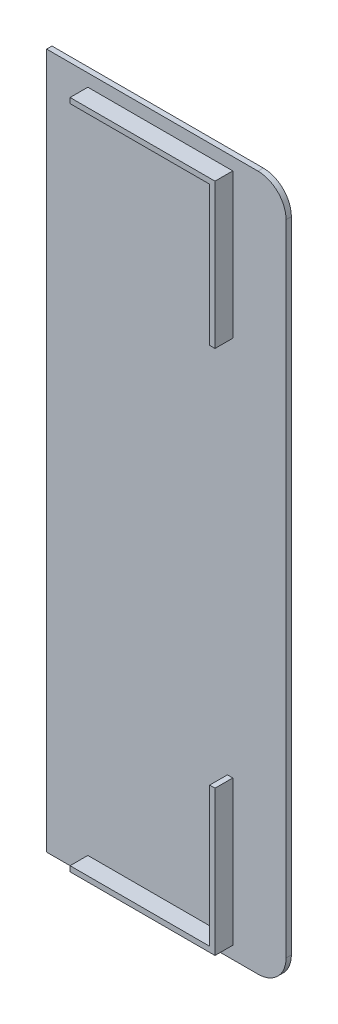
ISO-10303-21;
HEADER;
FILE_DESCRIPTION(('STEP AP214'),'2;1');
FILE_NAME('part.step','',(''),(''),'','','');
FILE_SCHEMA(('AUTOMOTIVE_DESIGN { 1 0 10303 214 1 1 1 1 }'));
ENDSEC;
DATA;
#1=APPLICATION_CONTEXT('core data for automotive mechanical design processes');
#2=APPLICATION_PROTOCOL_DEFINITION('international standard','automotive_design',2000,#1);
#3=PRODUCT_CONTEXT('',#1,'mechanical');
#4=PRODUCT('Part','Part','',(#3));
#5=PRODUCT_RELATED_PRODUCT_CATEGORY('part','',(#4));
#6=PRODUCT_DEFINITION_FORMATION('','',#4);
#7=PRODUCT_DEFINITION_CONTEXT('part definition',#1,'design');
#8=PRODUCT_DEFINITION('design','',#6,#7);
#9=PRODUCT_DEFINITION_SHAPE('','',#8);
#10=(LENGTH_UNIT() NAMED_UNIT(*) SI_UNIT(.MILLI.,.METRE.));
#11=(NAMED_UNIT(*) PLANE_ANGLE_UNIT() SI_UNIT($,.RADIAN.));
#12=(NAMED_UNIT(*) SI_UNIT($,.STERADIAN.) SOLID_ANGLE_UNIT());
#13=UNCERTAINTY_MEASURE_WITH_UNIT(LENGTH_MEASURE(1.E-05),#10,'distance_accuracy_value','');
#14=(GEOMETRIC_REPRESENTATION_CONTEXT(3) GLOBAL_UNCERTAINTY_ASSIGNED_CONTEXT((#13)) GLOBAL_UNIT_ASSIGNED_CONTEXT((#10,
#11,#12)) REPRESENTATION_CONTEXT('',''));
#15=CARTESIAN_POINT('',(0.,0.,0.));
#16=DIRECTION('',(0.,0.,1.));
#17=DIRECTION('',(1.,0.,0.));
#18=AXIS2_PLACEMENT_3D('',#15,#16,#17);
#19=CARTESIAN_POINT('',(0.,0.,-60.5));
#20=DIRECTION('',(0.,0.,1.));
#21=DIRECTION('',(1.,0.,0.));
#22=AXIS2_PLACEMENT_3D('',#19,#20,#21);
#23=PLANE('',#22);
#24=DIRECTION('',(0.,-1.,0.));
#25=VECTOR('',#24,1.);
#26=CARTESIAN_POINT('',(141.4,0.,-60.5));
#27=LINE('',#26,#25);
#28=CARTESIAN_POINT('',(141.4,92.9,-60.5));
#29=VERTEX_POINT('',#28);
#30=CARTESIAN_POINT('',(141.4,53.6,-60.5));
#31=VERTEX_POINT('',#30);
#32=EDGE_CURVE('E193',#29,#31,#27,.T.);
#33=ORIENTED_EDGE('',*,*,#32,.F.);
#34=DIRECTION('',(1.,0.,0.));
#35=VECTOR('',#34,1.);
#36=CARTESIAN_POINT('',(0.,92.9,-60.5));
#37=LINE('',#36,#35);
#38=CARTESIAN_POINT('',(102.1,92.9,-60.5));
#39=VERTEX_POINT('',#38);
#40=EDGE_CURVE('E179',#39,#29,#37,.T.);
#41=ORIENTED_EDGE('',*,*,#40,.F.);
#42=DIRECTION('',(0.,-1.,0.));
#43=VECTOR('',#42,1.);
#44=CARTESIAN_POINT('',(102.099999999998,-1.88922951357044E-12,-60.5));
#45=LINE('',#44,#43);
#46=CARTESIAN_POINT('',(102.1,94.4,-60.5));
#47=VERTEX_POINT('',#46);
#48=EDGE_CURVE('E170',#47,#39,#45,.T.);
#49=ORIENTED_EDGE('',*,*,#48,.F.);
#50=DIRECTION('',(-1.,0.,0.));
#51=VECTOR('',#50,1.);
#52=CARTESIAN_POINT('',(0.,94.4,-60.5));
#53=LINE('',#52,#51);
#54=CARTESIAN_POINT('',(142.9,94.4,-60.5));
#55=VERTEX_POINT('',#54);
#56=EDGE_CURVE('E188',#55,#47,#53,.T.);
#57=ORIENTED_EDGE('',*,*,#56,.F.);
#58=DIRECTION('',(0.,1.,0.));
#59=VECTOR('',#58,1.);
#60=CARTESIAN_POINT('',(142.9,0.,-60.5));
#61=LINE('',#60,#59);
#62=CARTESIAN_POINT('',(142.9,53.6,-60.5));
#63=VERTEX_POINT('',#62);
#64=EDGE_CURVE('E52',#63,#55,#61,.T.);
#65=ORIENTED_EDGE('',*,*,#64,.F.);
#66=DIRECTION('',(1.,0.,0.));
#67=VECTOR('',#66,1.);
#68=CARTESIAN_POINT('',(0.,53.6,-60.5));
#69=LINE('',#68,#67);
#70=EDGE_CURVE('E47',#31,#63,#69,.T.);
#71=ORIENTED_EDGE('',*,*,#70,.F.);
#72=EDGE_LOOP('',(#33,#41,#49,#57,#65,#71));
#73=FACE_BOUND('',#72,.T.);
#74=DIRECTION('',(0.,-1.,0.));
#75=VECTOR('',#74,1.);
#76=CARTESIAN_POINT('',(141.4,0.,-60.5));
#77=LINE('',#76,#75);
#78=CARTESIAN_POINT('',(141.4,-53.6,-60.5));
#79=VERTEX_POINT('',#78);
#80=CARTESIAN_POINT('',(141.4,-92.9,-60.5));
#81=VERTEX_POINT('',#80);
#82=EDGE_CURVE('E240',#79,#81,#77,.T.);
#83=ORIENTED_EDGE('',*,*,#82,.F.);
#84=DIRECTION('',(-1.,0.,0.));
#85=VECTOR('',#84,1.);
#86=CARTESIAN_POINT('',(0.,-53.6,-60.5));
#87=LINE('',#86,#85);
#88=CARTESIAN_POINT('',(142.9,-53.6,-60.5));
#89=VERTEX_POINT('',#88);
#90=EDGE_CURVE('E225',#89,#79,#87,.T.);
#91=ORIENTED_EDGE('',*,*,#90,.F.);
#92=DIRECTION('',(0.,1.,0.));
#93=VECTOR('',#92,1.);
#94=CARTESIAN_POINT('',(142.9,0.,-60.5));
#95=LINE('',#94,#93);
#96=CARTESIAN_POINT('',(142.9,-94.4,-60.5));
#97=VERTEX_POINT('',#96);
#98=EDGE_CURVE('E228',#97,#89,#95,.T.);
#99=ORIENTED_EDGE('',*,*,#98,.F.);
#100=DIRECTION('',(1.,0.,0.));
#101=VECTOR('',#100,1.);
#102=CARTESIAN_POINT('',(0.,-94.4,-60.5));
#103=LINE('',#102,#101);
#104=CARTESIAN_POINT('',(102.1,-94.4,-60.5));
#105=VERTEX_POINT('',#104);
#106=EDGE_CURVE('E231',#105,#97,#103,.T.);
#107=ORIENTED_EDGE('',*,*,#106,.F.);
#108=DIRECTION('',(0.,-1.,0.));
#109=VECTOR('',#108,1.);
#110=CARTESIAN_POINT('',(102.1,0.,-60.5));
#111=LINE('',#110,#109);
#112=CARTESIAN_POINT('',(102.1,-92.9,-60.5));
#113=VERTEX_POINT('',#112);
#114=EDGE_CURVE('E234',#113,#105,#111,.T.);
#115=ORIENTED_EDGE('',*,*,#114,.F.);
#116=DIRECTION('',(-1.,0.,0.));
#117=VECTOR('',#116,1.);
#118=CARTESIAN_POINT('',(0.,-92.9,-60.5));
#119=LINE('',#118,#117);
#120=EDGE_CURVE('E237',#81,#113,#119,.T.);
#121=ORIENTED_EDGE('',*,*,#120,.F.);
#122=EDGE_LOOP('',(#83,#91,#99,#107,#115,#121));
#123=FACE_BOUND('',#122,.T.);
#124=DIRECTION('',(0.,1.,0.));
#125=VECTOR('',#124,1.);
#126=CARTESIAN_POINT('',(90.5,-97.9,-60.5));
#127=LINE('',#126,#125);
#128=CARTESIAN_POINT('',(90.5,-97.9,-60.5));
#129=VERTEX_POINT('',#128);
#130=CARTESIAN_POINT('',(90.5,97.9,-60.5));
#131=VERTEX_POINT('',#130);
#132=EDGE_CURVE('E40',#129,#131,#127,.T.);
#133=ORIENTED_EDGE('',*,*,#132,.F.);
#134=DIRECTION('',(-1.,0.,0.));
#135=VECTOR('',#134,1.);
#136=CARTESIAN_POINT('',(150.,-97.9000000000001,-60.5));
#137=LINE('',#136,#135);
#138=CARTESIAN_POINT('',(150.,-97.9000000000001,-60.5));
#139=VERTEX_POINT('',#138);
#140=EDGE_CURVE('E268',#139,#129,#137,.T.);
#141=ORIENTED_EDGE('',*,*,#140,.F.);
#142=CARTESIAN_POINT('',(150.,-90.,-60.5));
#143=DIRECTION('',(0.,0.,1.));
#144=DIRECTION('',(1.,0.,0.));
#145=AXIS2_PLACEMENT_3D('',#142,#143,#144);
#146=CIRCLE('',#145,7.90000000000004);
#147=CARTESIAN_POINT('',(157.9,-90.,-60.5));
#148=VERTEX_POINT('',#147);
#149=EDGE_CURVE('E272',#148,#139,#146,.F.);
#150=ORIENTED_EDGE('',*,*,#149,.F.);
#151=DIRECTION('',(0.,-1.,0.));
#152=VECTOR('',#151,1.);
#153=CARTESIAN_POINT('',(157.9,90.,-60.5));
#154=LINE('',#153,#152);
#155=CARTESIAN_POINT('',(157.9,90.,-60.5));
#156=VERTEX_POINT('',#155);
#157=EDGE_CURVE('E276',#156,#148,#154,.T.);
#158=ORIENTED_EDGE('',*,*,#157,.F.);
#159=CARTESIAN_POINT('',(150.,90.,-60.5));
#160=DIRECTION('',(0.,0.,1.));
#161=DIRECTION('',(1.,0.,0.));
#162=AXIS2_PLACEMENT_3D('',#159,#160,#161);
#163=CIRCLE('',#162,7.90000000000002);
#164=CARTESIAN_POINT('',(150.,97.9,-60.4999999999999));
#165=VERTEX_POINT('',#164);
#166=EDGE_CURVE('E280',#165,#156,#163,.F.);
#167=ORIENTED_EDGE('',*,*,#166,.F.);
#168=DIRECTION('',(1.,0.,0.));
#169=VECTOR('',#168,1.);
#170=CARTESIAN_POINT('',(90.5,97.9,-60.5));
#171=LINE('',#170,#169);
#172=EDGE_CURVE('E247',#131,#165,#171,.T.);
#173=ORIENTED_EDGE('',*,*,#172,.F.);
#174=EDGE_LOOP('',(#133,#141,#150,#158,#167,#173));
#175=FACE_BOUND('',#174,.T.);
#176=ADVANCED_FACE('F33',(#73,#123,#175),#23,.T.);
#177=CARTESIAN_POINT('',(150.,90.,-62.));
#178=DIRECTION('',(0.,0.,-1.));
#179=DIRECTION('',(-1.,0.,0.));
#180=AXIS2_PLACEMENT_3D('',#177,#178,#179);
#181=PLANE('',#180);
#182=DIRECTION('',(0.,1.,0.));
#183=VECTOR('',#182,1.);
#184=CARTESIAN_POINT('',(90.5,-97.9,-62.));
#185=LINE('',#184,#183);
#186=CARTESIAN_POINT('',(90.5,-97.9,-62.));
#187=VERTEX_POINT('',#186);
#188=CARTESIAN_POINT('',(90.5,97.9,-62.));
#189=VERTEX_POINT('',#188);
#190=EDGE_CURVE('E243',#187,#189,#185,.T.);
#191=ORIENTED_EDGE('',*,*,#190,.T.);
#192=DIRECTION('',(1.,0.,0.));
#193=VECTOR('',#192,1.);
#194=CARTESIAN_POINT('',(90.5,97.9,-62.));
#195=LINE('',#194,#193);
#196=CARTESIAN_POINT('',(150.,97.9,-62.));
#197=VERTEX_POINT('',#196);
#198=EDGE_CURVE('E257',#189,#197,#195,.T.);
#199=ORIENTED_EDGE('',*,*,#198,.T.);
#200=CARTESIAN_POINT('',(150.,90.,-62.));
#201=DIRECTION('',(0.,0.,-1.));
#202=DIRECTION('',(-1.,0.,0.));
#203=AXIS2_PLACEMENT_3D('',#200,#201,#202);
#204=CIRCLE('',#203,7.90000000000002);
#205=CARTESIAN_POINT('',(157.9,90.,-62.));
#206=VERTEX_POINT('',#205);
#207=EDGE_CURVE('E254',#197,#206,#204,.T.);
#208=ORIENTED_EDGE('',*,*,#207,.T.);
#209=DIRECTION('',(0.,-1.,0.));
#210=VECTOR('',#209,1.);
#211=CARTESIAN_POINT('',(157.9,90.,-62.));
#212=LINE('',#211,#210);
#213=CARTESIAN_POINT('',(157.9,-90.,-62.));
#214=VERTEX_POINT('',#213);
#215=EDGE_CURVE('E251',#206,#214,#212,.T.);
#216=ORIENTED_EDGE('',*,*,#215,.T.);
#217=CARTESIAN_POINT('',(150.,-90.,-62.));
#218=DIRECTION('',(0.,0.,-1.));
#219=DIRECTION('',(-1.,0.,0.));
#220=AXIS2_PLACEMENT_3D('',#217,#218,#219);
#221=CIRCLE('',#220,7.90000000000004);
#222=CARTESIAN_POINT('',(150.,-97.9000000000001,-62.));
#223=VERTEX_POINT('',#222);
#224=EDGE_CURVE('E248',#214,#223,#221,.T.);
#225=ORIENTED_EDGE('',*,*,#224,.T.);
#226=DIRECTION('',(-1.,0.,0.));
#227=VECTOR('',#226,1.);
#228=CARTESIAN_POINT('',(150.,-97.9000000000001,-62.));
#229=LINE('',#228,#227);
#230=EDGE_CURVE('E244',#223,#187,#229,.T.);
#231=ORIENTED_EDGE('',*,*,#230,.T.);
#232=EDGE_LOOP('',(#191,#199,#208,#216,#225,#231));
#233=FACE_BOUND('',#232,.T.);
#234=ADVANCED_FACE('F297',(#233),#181,.T.);
#235=CARTESIAN_POINT('',(90.5,97.9,146.575831520726));
#236=DIRECTION('',(0.,1.,0.));
#237=DIRECTION('',(0.,0.,1.));
#238=AXIS2_PLACEMENT_3D('',#235,#236,#237);
#239=PLANE('',#238);
#240=DIRECTION('',(0.,0.,-1.));
#241=VECTOR('',#240,1.);
#242=CARTESIAN_POINT('',(90.5,97.9,146.575831520726));
#243=LINE('',#242,#241);
#244=EDGE_CURVE('E11',#131,#189,#243,.T.);
#245=ORIENTED_EDGE('',*,*,#244,.F.);
#246=ORIENTED_EDGE('',*,*,#172,.T.);
#247=DIRECTION('',(0.,0.,-1.));
#248=VECTOR('',#247,1.);
#249=CARTESIAN_POINT('',(150.,97.9,146.575831520726));
#250=LINE('',#249,#248);
#251=EDGE_CURVE('E264',#165,#197,#250,.T.);
#252=ORIENTED_EDGE('',*,*,#251,.T.);
#253=ORIENTED_EDGE('',*,*,#198,.F.);
#254=EDGE_LOOP('',(#245,#246,#252,#253));
#255=FACE_BOUND('',#254,.T.);
#256=ADVANCED_FACE('F291',(#255),#239,.T.);
#257=CARTESIAN_POINT('',(150.,90.,146.575831520726));
#258=DIRECTION('',(0.,0.,-1.));
#259=DIRECTION('',(-1.,0.,0.));
#260=AXIS2_PLACEMENT_3D('',#257,#258,#259);
#261=CYLINDRICAL_SURFACE('',#260,7.90000000000002);
#262=ORIENTED_EDGE('',*,*,#251,.F.);
#263=ORIENTED_EDGE('',*,*,#166,.T.);
#264=DIRECTION('',(0.,0.,-1.));
#265=VECTOR('',#264,1.);
#266=CARTESIAN_POINT('',(157.9,90.,146.575831520726));
#267=LINE('',#266,#265);
#268=EDGE_CURVE('E279',#156,#206,#267,.T.);
#269=ORIENTED_EDGE('',*,*,#268,.T.);
#270=ORIENTED_EDGE('',*,*,#207,.F.);
#271=EDGE_LOOP('',(#262,#263,#269,#270));
#272=FACE_BOUND('',#271,.T.);
#273=ADVANCED_FACE('F293',(#272),#261,.T.);
#274=CARTESIAN_POINT('',(157.9,90.,146.575831520726));
#275=DIRECTION('',(1.,0.,0.));
#276=DIRECTION('',(0.,1.,0.));
#277=AXIS2_PLACEMENT_3D('',#274,#275,#276);
#278=PLANE('',#277);
#279=ORIENTED_EDGE('',*,*,#268,.F.);
#280=ORIENTED_EDGE('',*,*,#157,.T.);
#281=DIRECTION('',(0.,0.,-1.));
#282=VECTOR('',#281,1.);
#283=CARTESIAN_POINT('',(157.9,-90.,146.575831520726));
#284=LINE('',#283,#282);
#285=EDGE_CURVE('E275',#148,#214,#284,.T.);
#286=ORIENTED_EDGE('',*,*,#285,.T.);
#287=ORIENTED_EDGE('',*,*,#215,.F.);
#288=EDGE_LOOP('',(#279,#280,#286,#287));
#289=FACE_BOUND('',#288,.T.);
#290=ADVANCED_FACE('F307',(#289),#278,.T.);
#291=CARTESIAN_POINT('',(150.,-90.,146.575831520726));
#292=DIRECTION('',(0.,0.,-1.));
#293=DIRECTION('',(-1.,0.,0.));
#294=AXIS2_PLACEMENT_3D('',#291,#292,#293);
#295=CYLINDRICAL_SURFACE('',#294,7.90000000000004);
#296=ORIENTED_EDGE('',*,*,#285,.F.);
#297=ORIENTED_EDGE('',*,*,#149,.T.);
#298=DIRECTION('',(0.,0.,-1.));
#299=VECTOR('',#298,1.);
#300=CARTESIAN_POINT('',(150.,-97.9000000000001,146.575831520726));
#301=LINE('',#300,#299);
#302=EDGE_CURVE('E271',#139,#223,#301,.T.);
#303=ORIENTED_EDGE('',*,*,#302,.T.);
#304=ORIENTED_EDGE('',*,*,#224,.F.);
#305=EDGE_LOOP('',(#296,#297,#303,#304));
#306=FACE_BOUND('',#305,.T.);
#307=ADVANCED_FACE('F312',(#306),#295,.T.);
#308=CARTESIAN_POINT('',(150.,-97.9000000000001,146.575831520726));
#309=DIRECTION('',(0.,-1.,0.));
#310=DIRECTION('',(1.,0.,0.));
#311=AXIS2_PLACEMENT_3D('',#308,#309,#310);
#312=PLANE('',#311);
#313=ORIENTED_EDGE('',*,*,#302,.F.);
#314=ORIENTED_EDGE('',*,*,#140,.T.);
#315=DIRECTION('',(0.,0.,-1.));
#316=VECTOR('',#315,1.);
#317=CARTESIAN_POINT('',(90.5,-97.9,146.575831520726));
#318=LINE('',#317,#316);
#319=EDGE_CURVE('E267',#129,#187,#318,.T.);
#320=ORIENTED_EDGE('',*,*,#319,.T.);
#321=ORIENTED_EDGE('',*,*,#230,.F.);
#322=EDGE_LOOP('',(#313,#314,#320,#321));
#323=FACE_BOUND('',#322,.T.);
#324=ADVANCED_FACE('F311',(#323),#312,.T.);
#325=CARTESIAN_POINT('',(90.5,-97.9,146.575831520726));
#326=DIRECTION('',(-1.,0.,0.));
#327=DIRECTION('',(0.,0.,1.));
#328=AXIS2_PLACEMENT_3D('',#325,#326,#327);
#329=PLANE('',#328);
#330=ORIENTED_EDGE('',*,*,#319,.F.);
#331=ORIENTED_EDGE('',*,*,#132,.T.);
#332=ORIENTED_EDGE('',*,*,#244,.T.);
#333=ORIENTED_EDGE('',*,*,#190,.F.);
#334=EDGE_LOOP('',(#330,#331,#332,#333));
#335=FACE_BOUND('',#334,.T.);
#336=ADVANCED_FACE('F302',(#335),#329,.T.);
#337=CARTESIAN_POINT('',(141.4,-92.9,2.19991334482228));
#338=DIRECTION('',(-1.,0.,0.));
#339=DIRECTION('',(0.,0.,1.));
#340=AXIS2_PLACEMENT_3D('',#337,#338,#339);
#341=PLANE('',#340);
#342=DIRECTION('',(0.,0.,-1.));
#343=VECTOR('',#342,1.);
#344=CARTESIAN_POINT('',(141.4,-53.6,2.19991334482228));
#345=LINE('',#344,#343);
#346=CARTESIAN_POINT('',(141.4,-53.6,-55.5));
#347=VERTEX_POINT('',#346);
#348=EDGE_CURVE('E195',#347,#79,#345,.T.);
#349=ORIENTED_EDGE('',*,*,#348,.T.);
#350=ORIENTED_EDGE('',*,*,#82,.T.);
#351=DIRECTION('',(0.,0.,-1.));
#352=VECTOR('',#351,1.);
#353=CARTESIAN_POINT('',(141.4,-92.9,2.19991334482228));
#354=LINE('',#353,#352);
#355=CARTESIAN_POINT('',(141.4,-92.9,-55.5));
#356=VERTEX_POINT('',#355);
#357=EDGE_CURVE('E199',#356,#81,#354,.T.);
#358=ORIENTED_EDGE('',*,*,#357,.F.);
#359=DIRECTION('',(0.,-1.,0.));
#360=VECTOR('',#359,1.);
#361=CARTESIAN_POINT('',(141.4,-92.9,-55.5));
#362=LINE('',#361,#360);
#363=EDGE_CURVE('E205',#347,#356,#362,.T.);
#364=ORIENTED_EDGE('',*,*,#363,.F.);
#365=EDGE_LOOP('',(#349,#350,#358,#364));
#366=FACE_BOUND('',#365,.T.);
#367=ADVANCED_FACE('F335',(#366),#341,.T.);
#368=CARTESIAN_POINT('',(102.1,-92.9,2.19991334482228));
#369=DIRECTION('',(0.,1.,0.));
#370=DIRECTION('',(0.,0.,1.));
#371=AXIS2_PLACEMENT_3D('',#368,#369,#370);
#372=PLANE('',#371);
#373=ORIENTED_EDGE('',*,*,#357,.T.);
#374=ORIENTED_EDGE('',*,*,#120,.T.);
#375=DIRECTION('',(0.,0.,-1.));
#376=VECTOR('',#375,1.);
#377=CARTESIAN_POINT('',(102.1,-92.9,2.19991334482228));
#378=LINE('',#377,#376);
#379=CARTESIAN_POINT('',(102.1,-92.9,-55.5));
#380=VERTEX_POINT('',#379);
#381=EDGE_CURVE('E210',#380,#113,#378,.T.);
#382=ORIENTED_EDGE('',*,*,#381,.F.);
#383=DIRECTION('',(-1.,0.,0.));
#384=VECTOR('',#383,1.);
#385=CARTESIAN_POINT('',(102.1,-92.9,-55.5));
#386=LINE('',#385,#384);
#387=EDGE_CURVE('E203',#356,#380,#386,.T.);
#388=ORIENTED_EDGE('',*,*,#387,.F.);
#389=EDGE_LOOP('',(#373,#374,#382,#388));
#390=FACE_BOUND('',#389,.T.);
#391=ADVANCED_FACE('F342',(#390),#372,.T.);
#392=CARTESIAN_POINT('',(102.1,-94.4,2.19991334482228));
#393=DIRECTION('',(-1.,0.,0.));
#394=DIRECTION('',(0.,0.,1.));
#395=AXIS2_PLACEMENT_3D('',#392,#393,#394);
#396=PLANE('',#395);
#397=ORIENTED_EDGE('',*,*,#381,.T.);
#398=ORIENTED_EDGE('',*,*,#114,.T.);
#399=DIRECTION('',(0.,0.,-1.));
#400=VECTOR('',#399,1.);
#401=CARTESIAN_POINT('',(102.1,-94.4,2.19991334482228));
#402=LINE('',#401,#400);
#403=CARTESIAN_POINT('',(102.1,-94.4,-55.5));
#404=VERTEX_POINT('',#403);
#405=EDGE_CURVE('E213',#404,#105,#402,.T.);
#406=ORIENTED_EDGE('',*,*,#405,.F.);
#407=DIRECTION('',(0.,-1.,0.));
#408=VECTOR('',#407,1.);
#409=CARTESIAN_POINT('',(102.1,-94.4,-55.5));
#410=LINE('',#409,#408);
#411=EDGE_CURVE('E201',#380,#404,#410,.T.);
#412=ORIENTED_EDGE('',*,*,#411,.F.);
#413=EDGE_LOOP('',(#397,#398,#406,#412));
#414=FACE_BOUND('',#413,.T.);
#415=ADVANCED_FACE('F344',(#414),#396,.T.);
#416=CARTESIAN_POINT('',(102.1,-94.4,2.19991334482228));
#417=DIRECTION('',(0.,-1.,0.));
#418=DIRECTION('',(0.,0.,-1.));
#419=AXIS2_PLACEMENT_3D('',#416,#417,#418);
#420=PLANE('',#419);
#421=ORIENTED_EDGE('',*,*,#405,.T.);
#422=ORIENTED_EDGE('',*,*,#106,.T.);
#423=DIRECTION('',(0.,0.,-1.));
#424=VECTOR('',#423,1.);
#425=CARTESIAN_POINT('',(142.9,-94.4,2.19991334482228));
#426=LINE('',#425,#424);
#427=CARTESIAN_POINT('',(142.9,-94.4,-55.5));
#428=VERTEX_POINT('',#427);
#429=EDGE_CURVE('E216',#428,#97,#426,.T.);
#430=ORIENTED_EDGE('',*,*,#429,.F.);
#431=DIRECTION('',(1.,0.,0.));
#432=VECTOR('',#431,1.);
#433=CARTESIAN_POINT('',(102.1,-94.4,-55.5));
#434=LINE('',#433,#432);
#435=EDGE_CURVE('E198',#404,#428,#434,.T.);
#436=ORIENTED_EDGE('',*,*,#435,.F.);
#437=EDGE_LOOP('',(#421,#422,#430,#436));
#438=FACE_BOUND('',#437,.T.);
#439=ADVANCED_FACE('F350',(#438),#420,.T.);
#440=CARTESIAN_POINT('',(142.9,-94.4,2.19991334482228));
#441=DIRECTION('',(1.,0.,0.));
#442=DIRECTION('',(0.,0.,-1.));
#443=AXIS2_PLACEMENT_3D('',#440,#441,#442);
#444=PLANE('',#443);
#445=ORIENTED_EDGE('',*,*,#429,.T.);
#446=ORIENTED_EDGE('',*,*,#98,.T.);
#447=DIRECTION('',(0.,0.,-1.));
#448=VECTOR('',#447,1.);
#449=CARTESIAN_POINT('',(142.9,-53.6,2.19991334482228));
#450=LINE('',#449,#448);
#451=CARTESIAN_POINT('',(142.9,-53.6,-55.5));
#452=VERTEX_POINT('',#451);
#453=EDGE_CURVE('E219',#452,#89,#450,.T.);
#454=ORIENTED_EDGE('',*,*,#453,.F.);
#455=DIRECTION('',(0.,1.,0.));
#456=VECTOR('',#455,1.);
#457=CARTESIAN_POINT('',(142.9,-94.4,-55.5));
#458=LINE('',#457,#456);
#459=EDGE_CURVE('E196',#428,#452,#458,.T.);
#460=ORIENTED_EDGE('',*,*,#459,.F.);
#461=EDGE_LOOP('',(#445,#446,#454,#460));
#462=FACE_BOUND('',#461,.T.);
#463=ADVANCED_FACE('F352',(#462),#444,.T.);
#464=CARTESIAN_POINT('',(142.9,-53.6,2.19991334482228));
#465=DIRECTION('',(0.,1.,0.));
#466=DIRECTION('',(0.,0.,1.));
#467=AXIS2_PLACEMENT_3D('',#464,#465,#466);
#468=PLANE('',#467);
#469=ORIENTED_EDGE('',*,*,#453,.T.);
#470=ORIENTED_EDGE('',*,*,#90,.T.);
#471=ORIENTED_EDGE('',*,*,#348,.F.);
#472=DIRECTION('',(-1.,0.,0.));
#473=VECTOR('',#472,1.);
#474=CARTESIAN_POINT('',(142.9,-53.6,-55.5));
#475=LINE('',#474,#473);
#476=EDGE_CURVE('E207',#452,#347,#475,.T.);
#477=ORIENTED_EDGE('',*,*,#476,.F.);
#478=EDGE_LOOP('',(#469,#470,#471,#477));
#479=FACE_BOUND('',#478,.T.);
#480=ADVANCED_FACE('F331',(#479),#468,.T.);
#481=CARTESIAN_POINT('',(0.,0.,-55.5));
#482=DIRECTION('',(0.,0.,-1.));
#483=DIRECTION('',(-1.,0.,0.));
#484=AXIS2_PLACEMENT_3D('',#481,#482,#483);
#485=PLANE('',#484);
#486=ORIENTED_EDGE('',*,*,#363,.T.);
#487=ORIENTED_EDGE('',*,*,#387,.T.);
#488=ORIENTED_EDGE('',*,*,#411,.T.);
#489=ORIENTED_EDGE('',*,*,#435,.T.);
#490=ORIENTED_EDGE('',*,*,#459,.T.);
#491=ORIENTED_EDGE('',*,*,#476,.T.);
#492=EDGE_LOOP('',(#486,#487,#488,#489,#490,#491));
#493=FACE_BOUND('',#492,.T.);
#494=ADVANCED_FACE('F338',(#493),#485,.F.);
#495=CARTESIAN_POINT('',(141.4,92.9,2.19991334482228));
#496=DIRECTION('',(-1.,0.,0.));
#497=DIRECTION('',(0.,0.,1.));
#498=AXIS2_PLACEMENT_3D('',#495,#496,#497);
#499=PLANE('',#498);
#500=DIRECTION('',(0.,0.,-1.));
#501=VECTOR('',#500,1.);
#502=CARTESIAN_POINT('',(141.4,92.9,2.19991334482228));
#503=LINE('',#502,#501);
#504=CARTESIAN_POINT('',(141.4,92.9,-55.5));
#505=VERTEX_POINT('',#504);
#506=EDGE_CURVE('E174',#505,#29,#503,.T.);
#507=ORIENTED_EDGE('',*,*,#506,.T.);
#508=ORIENTED_EDGE('',*,*,#32,.T.);
#509=DIRECTION('',(0.,0.,-1.));
#510=VECTOR('',#509,1.);
#511=CARTESIAN_POINT('',(141.4,53.6,2.19991334482228));
#512=LINE('',#511,#510);
#513=CARTESIAN_POINT('',(141.4,53.6,-55.5));
#514=VERTEX_POINT('',#513);
#515=EDGE_CURVE('E164',#514,#31,#512,.T.);
#516=ORIENTED_EDGE('',*,*,#515,.F.);
#517=DIRECTION('',(0.,-1.,0.));
#518=VECTOR('',#517,1.);
#519=CARTESIAN_POINT('',(141.4,92.9,-55.5));
#520=LINE('',#519,#518);
#521=EDGE_CURVE('E180',#505,#514,#520,.T.);
#522=ORIENTED_EDGE('',*,*,#521,.F.);
#523=EDGE_LOOP('',(#507,#508,#516,#522));
#524=FACE_BOUND('',#523,.T.);
#525=ADVANCED_FACE('F414',(#524),#499,.T.);
#526=CARTESIAN_POINT('',(142.9,53.6,2.19991334482228));
#527=DIRECTION('',(0.,-1.,0.));
#528=DIRECTION('',(0.,0.,-1.));
#529=AXIS2_PLACEMENT_3D('',#526,#527,#528);
#530=PLANE('',#529);
#531=ORIENTED_EDGE('',*,*,#515,.T.);
#532=ORIENTED_EDGE('',*,*,#70,.T.);
#533=DIRECTION('',(0.,0.,-1.));
#534=VECTOR('',#533,1.);
#535=CARTESIAN_POINT('',(142.9,53.6,2.19991334482228));
#536=LINE('',#535,#534);
#537=CARTESIAN_POINT('',(142.9,53.6,-55.5));
#538=VERTEX_POINT('',#537);
#539=EDGE_CURVE('E522',#538,#63,#536,.T.);
#540=ORIENTED_EDGE('',*,*,#539,.F.);
#541=DIRECTION('',(1.,0.,0.));
#542=VECTOR('',#541,1.);
#543=CARTESIAN_POINT('',(142.9,53.6,-55.5));
#544=LINE('',#543,#542);
#545=EDGE_CURVE('E183',#514,#538,#544,.T.);
#546=ORIENTED_EDGE('',*,*,#545,.F.);
#547=EDGE_LOOP('',(#531,#532,#540,#546));
#548=FACE_BOUND('',#547,.T.);
#549=ADVANCED_FACE('F423',(#548),#530,.T.);
#550=CARTESIAN_POINT('',(142.9,94.4,2.19991334482228));
#551=DIRECTION('',(1.,0.,0.));
#552=DIRECTION('',(0.,0.,-1.));
#553=AXIS2_PLACEMENT_3D('',#550,#551,#552);
#554=PLANE('',#553);
#555=ORIENTED_EDGE('',*,*,#539,.T.);
#556=ORIENTED_EDGE('',*,*,#64,.T.);
#557=DIRECTION('',(0.,0.,-1.));
#558=VECTOR('',#557,1.);
#559=CARTESIAN_POINT('',(142.9,94.4,2.19991334482228));
#560=LINE('',#559,#558);
#561=CARTESIAN_POINT('',(142.9,94.4,-55.5));
#562=VERTEX_POINT('',#561);
#563=EDGE_CURVE('E520',#562,#55,#560,.T.);
#564=ORIENTED_EDGE('',*,*,#563,.F.);
#565=DIRECTION('',(0.,1.,0.));
#566=VECTOR('',#565,1.);
#567=CARTESIAN_POINT('',(142.9,94.4,-55.5));
#568=LINE('',#567,#566);
#569=EDGE_CURVE('E531',#538,#562,#568,.T.);
#570=ORIENTED_EDGE('',*,*,#569,.F.);
#571=EDGE_LOOP('',(#555,#556,#564,#570));
#572=FACE_BOUND('',#571,.T.);
#573=ADVANCED_FACE('F433',(#572),#554,.T.);
#574=CARTESIAN_POINT('',(102.1,94.4,2.19991334482228));
#575=DIRECTION('',(0.,1.,0.));
#576=DIRECTION('',(0.,0.,1.));
#577=AXIS2_PLACEMENT_3D('',#574,#575,#576);
#578=PLANE('',#577);
#579=ORIENTED_EDGE('',*,*,#563,.T.);
#580=ORIENTED_EDGE('',*,*,#56,.T.);
#581=DIRECTION('',(0.,0.,-1.));
#582=VECTOR('',#581,1.);
#583=CARTESIAN_POINT('',(102.1,94.4,2.19991334482228));
#584=LINE('',#583,#582);
#585=CARTESIAN_POINT('',(102.1,94.4,-55.5));
#586=VERTEX_POINT('',#585);
#587=EDGE_CURVE('E173',#586,#47,#584,.T.);
#588=ORIENTED_EDGE('',*,*,#587,.F.);
#589=DIRECTION('',(-1.,0.,0.));
#590=VECTOR('',#589,1.);
#591=CARTESIAN_POINT('',(102.1,94.4,-55.5));
#592=LINE('',#591,#590);
#593=EDGE_CURVE('E160',#562,#586,#592,.T.);
#594=ORIENTED_EDGE('',*,*,#593,.F.);
#595=EDGE_LOOP('',(#579,#580,#588,#594));
#596=FACE_BOUND('',#595,.T.);
#597=ADVANCED_FACE('F443',(#596),#578,.T.);
#598=CARTESIAN_POINT('',(102.1,94.4,2.19991334482228));
#599=DIRECTION('',(-1.,0.,0.));
#600=DIRECTION('',(0.,-1.,0.));
#601=AXIS2_PLACEMENT_3D('',#598,#599,#600);
#602=PLANE('',#601);
#603=ORIENTED_EDGE('',*,*,#587,.T.);
#604=ORIENTED_EDGE('',*,*,#48,.T.);
#605=DIRECTION('',(0.,0.,-1.));
#606=VECTOR('',#605,1.);
#607=CARTESIAN_POINT('',(102.1,92.9,2.19991334482228));
#608=LINE('',#607,#606);
#609=CARTESIAN_POINT('',(102.1,92.9,-55.5));
#610=VERTEX_POINT('',#609);
#611=EDGE_CURVE('E168',#610,#39,#608,.T.);
#612=ORIENTED_EDGE('',*,*,#611,.F.);
#613=DIRECTION('',(0.,-1.,0.));
#614=VECTOR('',#613,1.);
#615=CARTESIAN_POINT('',(102.1,94.4,-55.5));
#616=LINE('',#615,#614);
#617=EDGE_CURVE('E153',#586,#610,#616,.T.);
#618=ORIENTED_EDGE('',*,*,#617,.F.);
#619=EDGE_LOOP('',(#603,#604,#612,#618));
#620=FACE_BOUND('',#619,.T.);
#621=ADVANCED_FACE('F169',(#620),#602,.T.);
#622=CARTESIAN_POINT('',(102.1,92.9,2.19991334482228));
#623=DIRECTION('',(0.,-1.,0.));
#624=DIRECTION('',(0.,0.,-1.));
#625=AXIS2_PLACEMENT_3D('',#622,#623,#624);
#626=PLANE('',#625);
#627=ORIENTED_EDGE('',*,*,#611,.T.);
#628=ORIENTED_EDGE('',*,*,#40,.T.);
#629=ORIENTED_EDGE('',*,*,#506,.F.);
#630=DIRECTION('',(1.,0.,0.));
#631=VECTOR('',#630,1.);
#632=CARTESIAN_POINT('',(102.1,92.9,-55.5));
#633=LINE('',#632,#631);
#634=EDGE_CURVE('E157',#610,#505,#633,.T.);
#635=ORIENTED_EDGE('',*,*,#634,.F.);
#636=EDGE_LOOP('',(#627,#628,#629,#635));
#637=FACE_BOUND('',#636,.T.);
#638=ADVANCED_FACE('F177',(#637),#626,.T.);
#639=CARTESIAN_POINT('',(0.,0.,-55.5));
#640=DIRECTION('',(0.,0.,-1.));
#641=DIRECTION('',(-1.,0.,0.));
#642=AXIS2_PLACEMENT_3D('',#639,#640,#641);
#643=PLANE('',#642);
#644=ORIENTED_EDGE('',*,*,#521,.T.);
#645=ORIENTED_EDGE('',*,*,#545,.T.);
#646=ORIENTED_EDGE('',*,*,#569,.T.);
#647=ORIENTED_EDGE('',*,*,#593,.T.);
#648=ORIENTED_EDGE('',*,*,#617,.T.);
#649=ORIENTED_EDGE('',*,*,#634,.T.);
#650=EDGE_LOOP('',(#644,#645,#646,#647,#648,#649));
#651=FACE_BOUND('',#650,.T.);
#652=ADVANCED_FACE('F155',(#651),#643,.F.);
#653=CLOSED_SHELL('',(#176,#234,#256,#273,#290,#307,#324,#336,#367,#391,#415,#439,#463,#480,
#494,#525,#549,#573,#597,#621,#638,#652));
#654=MANIFOLD_SOLID_BREP('B2',#653);
#655=ADVANCED_BREP_SHAPE_REPRESENTATION('',(#18,#654),#14);
#656=SHAPE_DEFINITION_REPRESENTATION(#9,#655);
ENDSEC;
END-ISO-10303-21;
